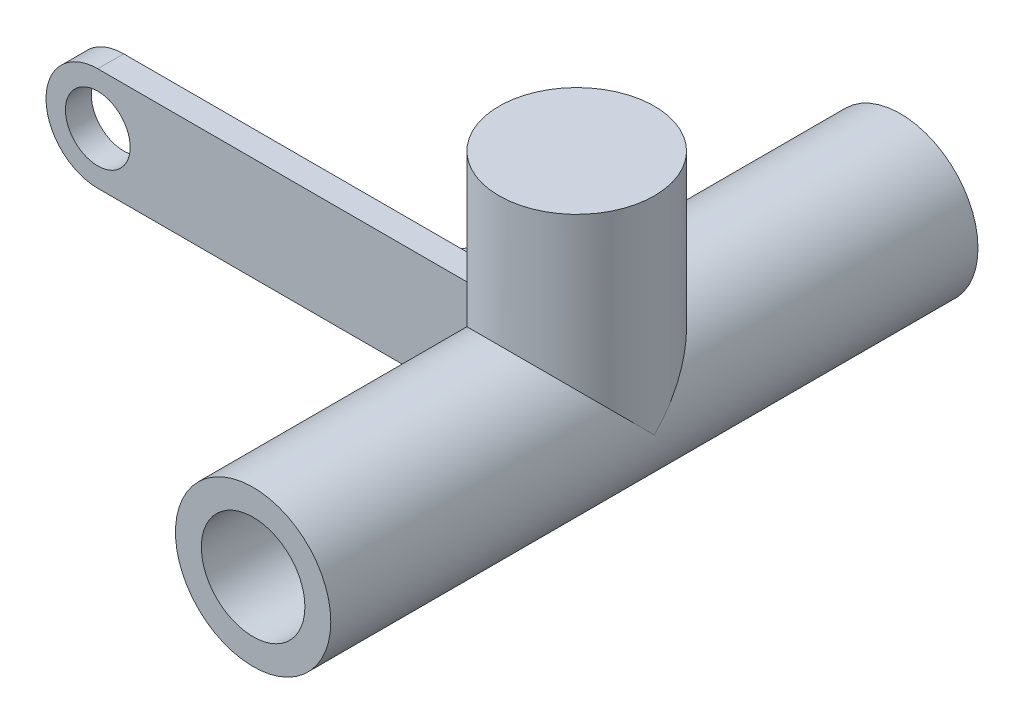
ISO-10303-21;
HEADER;
FILE_DESCRIPTION(('STEP AP214'),'2;1');
FILE_NAME('part.step','',(''),(''),'','','');
FILE_SCHEMA(('AUTOMOTIVE_DESIGN { 1 0 10303 214 1 1 1 1 }'));
ENDSEC;
DATA;
#1=APPLICATION_CONTEXT('core data for automotive mechanical design processes');
#2=APPLICATION_PROTOCOL_DEFINITION('international standard','automotive_design',2000,#1);
#3=PRODUCT_CONTEXT('',#1,'mechanical');
#4=PRODUCT('Part','Part','',(#3));
#5=PRODUCT_RELATED_PRODUCT_CATEGORY('part','',(#4));
#6=PRODUCT_DEFINITION_FORMATION('','',#4);
#7=PRODUCT_DEFINITION_CONTEXT('part definition',#1,'design');
#8=PRODUCT_DEFINITION('design','',#6,#7);
#9=PRODUCT_DEFINITION_SHAPE('','',#8);
#10=(LENGTH_UNIT() NAMED_UNIT(*) SI_UNIT(.MILLI.,.METRE.));
#11=(NAMED_UNIT(*) PLANE_ANGLE_UNIT() SI_UNIT($,.RADIAN.));
#12=(NAMED_UNIT(*) SI_UNIT($,.STERADIAN.) SOLID_ANGLE_UNIT());
#13=UNCERTAINTY_MEASURE_WITH_UNIT(LENGTH_MEASURE(1.E-05),#10,'distance_accuracy_value','');
#14=(GEOMETRIC_REPRESENTATION_CONTEXT(3) GLOBAL_UNCERTAINTY_ASSIGNED_CONTEXT((#13)) GLOBAL_UNIT_ASSIGNED_CONTEXT((#10,
#11,#12)) REPRESENTATION_CONTEXT('',''));
#15=CARTESIAN_POINT('',(0.,0.,0.));
#16=DIRECTION('',(0.,0.,1.));
#17=DIRECTION('',(1.,0.,0.));
#18=AXIS2_PLACEMENT_3D('',#15,#16,#17);
#19=CARTESIAN_POINT('',(0.,0.,125.));
#20=DIRECTION('',(0.,0.,-1.));
#21=DIRECTION('',(-1.,0.,0.));
#22=AXIS2_PLACEMENT_3D('',#19,#20,#21);
#23=CYLINDRICAL_SURFACE('',#22,15.);
#24=CARTESIAN_POINT('',(0.,0.,125.));
#25=DIRECTION('',(0.,0.,1.));
#26=DIRECTION('',(1.,0.,0.));
#27=AXIS2_PLACEMENT_3D('',#24,#25,#26);
#28=CIRCLE('',#27,15.);
#29=CARTESIAN_POINT('',(15.,0.,125.));
#30=VERTEX_POINT('',#29);
#31=EDGE_CURVE('E260',#30,#30,#28,.T.);
#32=ORIENTED_EDGE('',*,*,#31,.F.);
#33=EDGE_LOOP('',(#32));
#34=FACE_BOUND('',#33,.T.);
#35=CARTESIAN_POINT('',(0.,0.,0.));
#36=DIRECTION('',(0.,0.,1.));
#37=DIRECTION('',(1.,0.,0.));
#38=AXIS2_PLACEMENT_3D('',#35,#36,#37);
#39=CIRCLE('',#38,15.);
#40=CARTESIAN_POINT('',(15.,0.,0.));
#41=VERTEX_POINT('',#40);
#42=EDGE_CURVE('E256',#41,#41,#39,.T.);
#43=ORIENTED_EDGE('',*,*,#42,.T.);
#44=EDGE_LOOP('',(#43));
#45=FACE_BOUND('',#44,.T.);
#46=DIRECTION('',(0.,0.,-1.));
#47=VECTOR('',#46,1.);
#48=CARTESIAN_POINT('',(-14.9666295470958,-0.999999999999999,125.));
#49=LINE('',#48,#47);
#50=CARTESIAN_POINT('',(-14.9666295470958,-1.,30.));
#51=VERTEX_POINT('',#50);
#52=CARTESIAN_POINT('',(-14.9666295470958,-0.999999999999999,60.));
#53=VERTEX_POINT('',#52);
#54=EDGE_CURVE('E179',#51,#53,#49,.F.);
#55=ORIENTED_EDGE('',*,*,#54,.F.);
#56=CARTESIAN_POINT('',(0.,0.,30.));
#57=DIRECTION('',(0.,0.,-1.));
#58=DIRECTION('',(-1.,0.,0.));
#59=AXIS2_PLACEMENT_3D('',#56,#57,#58);
#60=CIRCLE('',#59,15.);
#61=CARTESIAN_POINT('',(-14.9666295470958,1.,30.));
#62=VERTEX_POINT('',#61);
#63=EDGE_CURVE('E11',#51,#62,#60,.T.);
#64=ORIENTED_EDGE('',*,*,#63,.T.);
#65=DIRECTION('',(0.,0.,-1.));
#66=VECTOR('',#65,1.);
#67=CARTESIAN_POINT('',(-14.9666295470958,1.,125.));
#68=LINE('',#67,#66);
#69=CARTESIAN_POINT('',(-14.9666295470958,1.,60.));
#70=VERTEX_POINT('',#69);
#71=EDGE_CURVE('E168',#70,#62,#68,.T.);
#72=ORIENTED_EDGE('',*,*,#71,.F.);
#73=CARTESIAN_POINT('',(0.,0.,60.));
#74=DIRECTION('',(0.,0.,-1.));
#75=DIRECTION('',(-1.,0.,0.));
#76=AXIS2_PLACEMENT_3D('',#73,#74,#75);
#77=CIRCLE('',#76,15.);
#78=CARTESIAN_POINT('',(-14.790199457749,2.5,60.));
#79=VERTEX_POINT('',#78);
#80=EDGE_CURVE('E175',#70,#79,#77,.T.);
#81=ORIENTED_EDGE('',*,*,#80,.T.);
#82=CARTESIAN_POINT('',(0.,0.,62.5));
#83=DIRECTION('',(0.,-0.707106781186547,-0.707106781186547));
#84=DIRECTION('',(0.,0.707106781186547,-0.707106781186547));
#85=AXIS2_PLACEMENT_3D('',#82,#83,#84);
#86=ELLIPSE('',#85,21.2132034355964,15.);
#87=CARTESIAN_POINT('',(15.,0.,62.5));
#88=VERTEX_POINT('',#87);
#89=EDGE_CURVE('E247',#88,#79,#86,.F.);
#90=ORIENTED_EDGE('',*,*,#89,.F.);
#91=CARTESIAN_POINT('',(0.,0.,62.5));
#92=DIRECTION('',(0.,0.707106781186547,-0.707106781186547));
#93=DIRECTION('',(0.,-0.707106781186547,-0.707106781186547));
#94=AXIS2_PLACEMENT_3D('',#91,#92,#93);
#95=ELLIPSE('',#94,21.2132034355964,15.);
#96=CARTESIAN_POINT('',(-14.790199457749,2.5,65.));
#97=VERTEX_POINT('',#96);
#98=EDGE_CURVE('E240',#97,#88,#95,.T.);
#99=ORIENTED_EDGE('',*,*,#98,.F.);
#100=CARTESIAN_POINT('',(0.,0.,65.));
#101=DIRECTION('',(0.,0.,1.));
#102=DIRECTION('',(1.,0.,0.));
#103=AXIS2_PLACEMENT_3D('',#100,#101,#102);
#104=CIRCLE('',#103,15.);
#105=CARTESIAN_POINT('',(-11.1803398874989,-10.,65.));
#106=VERTEX_POINT('',#105);
#107=EDGE_CURVE('E220',#97,#106,#104,.T.);
#108=ORIENTED_EDGE('',*,*,#107,.T.);
#109=DIRECTION('',(0.,0.,-1.));
#110=VECTOR('',#109,1.);
#111=CARTESIAN_POINT('',(-11.180339887499,-10.,125.));
#112=LINE('',#111,#110);
#113=CARTESIAN_POINT('',(-11.1803398874989,-10.,60.));
#114=VERTEX_POINT('',#113);
#115=EDGE_CURVE('E231',#106,#114,#112,.T.);
#116=ORIENTED_EDGE('',*,*,#115,.T.);
#117=EDGE_CURVE('E209',#114,#53,#77,.T.);
#118=ORIENTED_EDGE('',*,*,#117,.T.);
#119=EDGE_LOOP('',(#55,#64,#72,#81,#90,#99,#108,#116,#118));
#120=FACE_BOUND('',#119,.T.);
#121=ADVANCED_FACE('F43',(#34,#45,#120),#23,.T.);
#122=CARTESIAN_POINT('',(-100.,-10.,60.));
#123=DIRECTION('',(0.,0.,-1.));
#124=DIRECTION('',(-1.,0.,0.));
#125=AXIS2_PLACEMENT_3D('',#122,#123,#124);
#126=PLANE('',#125);
#127=CARTESIAN_POINT('',(-90.,0.,60.));
#128=DIRECTION('',(0.,0.,-1.));
#129=DIRECTION('',(-1.,0.,0.));
#130=AXIS2_PLACEMENT_3D('',#127,#128,#129);
#131=CIRCLE('',#130,6.25);
#132=CARTESIAN_POINT('',(-96.25,0.,60.));
#133=VERTEX_POINT('',#132);
#134=EDGE_CURVE('E438',#133,#133,#131,.T.);
#135=ORIENTED_EDGE('',*,*,#134,.F.);
#136=EDGE_LOOP('',(#135));
#137=FACE_BOUND('',#136,.T.);
#138=DIRECTION('',(1.,0.,0.));
#139=VECTOR('',#138,1.);
#140=CARTESIAN_POINT('',(-14.,1.,60.));
#141=LINE('',#140,#139);
#142=CARTESIAN_POINT('',(-42.03455484,1.,60.));
#143=VERTEX_POINT('',#142);
#144=EDGE_CURVE('E162',#143,#70,#141,.T.);
#145=ORIENTED_EDGE('',*,*,#144,.F.);
#146=DIRECTION('',(0.,1.,0.));
#147=VECTOR('',#146,1.);
#148=CARTESIAN_POINT('',(-42.03455484,1.,60.));
#149=LINE('',#148,#147);
#150=CARTESIAN_POINT('',(-42.03455484,-0.999999999999999,60.));
#151=VERTEX_POINT('',#150);
#152=EDGE_CURVE('E149',#151,#143,#149,.T.);
#153=ORIENTED_EDGE('',*,*,#152,.F.);
#154=DIRECTION('',(1.,0.,0.));
#155=VECTOR('',#154,1.);
#156=CARTESIAN_POINT('',(-100.,-0.999999999999999,60.));
#157=LINE('',#156,#155);
#158=EDGE_CURVE('E53',#151,#53,#157,.T.);
#159=ORIENTED_EDGE('',*,*,#158,.T.);
#160=ORIENTED_EDGE('',*,*,#117,.F.);
#161=DIRECTION('',(1.,0.,0.));
#162=VECTOR('',#161,1.);
#163=CARTESIAN_POINT('',(-100.,-10.,60.));
#164=LINE('',#163,#162);
#165=CARTESIAN_POINT('',(-90.,-10.,60.));
#166=VERTEX_POINT('',#165);
#167=EDGE_CURVE('E204',#166,#114,#164,.T.);
#168=ORIENTED_EDGE('',*,*,#167,.F.);
#169=CARTESIAN_POINT('',(-90.,0.,60.));
#170=DIRECTION('',(0.,0.,-1.));
#171=DIRECTION('',(-1.,0.,0.));
#172=AXIS2_PLACEMENT_3D('',#169,#170,#171);
#173=CIRCLE('',#172,10.);
#174=CARTESIAN_POINT('',(-100.,0.,60.));
#175=VERTEX_POINT('',#174);
#176=EDGE_CURVE('E376',#166,#175,#173,.T.);
#177=ORIENTED_EDGE('',*,*,#176,.T.);
#178=CARTESIAN_POINT('',(-90.,0.,60.));
#179=DIRECTION('',(0.,0.,-1.));
#180=DIRECTION('',(-1.,0.,0.));
#181=AXIS2_PLACEMENT_3D('',#178,#179,#180);
#182=CIRCLE('',#181,10.);
#183=CARTESIAN_POINT('',(-90.,10.,60.));
#184=VERTEX_POINT('',#183);
#185=EDGE_CURVE('E390',#175,#184,#182,.T.);
#186=ORIENTED_EDGE('',*,*,#185,.T.);
#187=DIRECTION('',(1.,0.,0.));
#188=VECTOR('',#187,1.);
#189=CARTESIAN_POINT('',(-100.,10.,60.));
#190=LINE('',#189,#188);
#191=CARTESIAN_POINT('',(-14.790199457749,10.,60.));
#192=VERTEX_POINT('',#191);
#193=EDGE_CURVE('E201',#184,#192,#190,.T.);
#194=ORIENTED_EDGE('',*,*,#193,.T.);
#195=DIRECTION('',(0.,-1.,0.));
#196=VECTOR('',#195,1.);
#197=CARTESIAN_POINT('',(-14.790199457749,40.,60.));
#198=LINE('',#197,#196);
#199=EDGE_CURVE('E409',#79,#192,#198,.F.);
#200=ORIENTED_EDGE('',*,*,#199,.F.);
#201=ORIENTED_EDGE('',*,*,#80,.F.);
#202=EDGE_LOOP('',(#145,#153,#159,#160,#168,#177,#186,#194,#200,#201));
#203=FACE_BOUND('',#202,.T.);
#204=ADVANCED_FACE('F173',(#137,#203),#126,.T.);
#205=CARTESIAN_POINT('',(0.,0.,125.));
#206=DIRECTION('',(0.,0.,-1.));
#207=DIRECTION('',(-1.,0.,0.));
#208=AXIS2_PLACEMENT_3D('',#205,#206,#207);
#209=CYLINDRICAL_SURFACE('',#208,10.);
#210=CARTESIAN_POINT('',(0.,0.,65.));
#211=DIRECTION('',(0.,0.,1.));
#212=DIRECTION('',(1.,0.,0.));
#213=AXIS2_PLACEMENT_3D('',#210,#211,#212);
#214=CIRCLE('',#213,10.);
#215=CARTESIAN_POINT('',(-10.,0.,65.));
#216=VERTEX_POINT('',#215);
#217=CARTESIAN_POINT('',(0.,-10.,65.));
#218=VERTEX_POINT('',#217);
#219=EDGE_CURVE('E228',#216,#218,#214,.T.);
#220=ORIENTED_EDGE('',*,*,#219,.F.);
#221=DIRECTION('',(0.,0.,-1.));
#222=VECTOR('',#221,1.);
#223=CARTESIAN_POINT('',(-10.,0.,125.));
#224=LINE('',#223,#222);
#225=CARTESIAN_POINT('',(-10.,0.,73.6803398874989));
#226=VERTEX_POINT('',#225);
#227=EDGE_CURVE('E264',#216,#226,#224,.F.);
#228=ORIENTED_EDGE('',*,*,#227,.T.);
#229=CARTESIAN_POINT('',(-10.,0.,73.6803398874989));
#230=CARTESIAN_POINT('',(-10.0000019662644,0.122908083291886,73.6803341285554));
#231=CARTESIAN_POINT('',(-9.99773339672962,0.245795438662537,73.682367652214));
#232=CARTESIAN_POINT('',(-9.98868075195431,0.491259157771999,73.6904562528802));
#233=CARTESIAN_POINT('',(-9.98189712810506,0.613835551369558,73.696510927874));
#234=CARTESIAN_POINT('',(-9.95484008556213,0.980341470499923,73.7205962021832));
#235=CARTESIAN_POINT('',(-9.92786031801124,1.22344075436707,73.7445484143372));
#236=CARTESIAN_POINT('',(-9.85692199140147,1.70271606910721,73.8067794801167));
#237=CARTESIAN_POINT('',(-9.81313360307206,1.93893674586964,73.8449146287484));
#238=CARTESIAN_POINT('',(-9.70933595979468,2.40539084014844,73.9338733583765));
#239=CARTESIAN_POINT('',(-9.64932198669643,2.63562249476913,73.9847006297178));
#240=CARTESIAN_POINT('',(-9.51430209888207,3.08762076307501,74.0967965567621));
#241=CARTESIAN_POINT('',(-9.43937638209315,3.30942540898784,74.1580091094161));
#242=CARTESIAN_POINT('',(-9.2752123820489,3.74494680876639,74.2890411827064));
#243=CARTESIAN_POINT('',(-9.18597482688439,3.95866397338595,74.3588602654582));
#244=CARTESIAN_POINT('',(-8.89735329466268,4.58807557587278,74.5787194524851));
#245=CARTESIAN_POINT('',(-8.67735629737759,4.9910554450501,74.7389043780611));
#246=CARTESIAN_POINT('',(-8.29129524792108,5.59675485228079,75.0013515100961));
#247=CARTESIAN_POINT('',(-8.14170204702141,5.81216410863114,75.0994998696131));
#248=CARTESIAN_POINT('',(-7.8264923183353,6.23012673255033,75.2976804602116));
#249=CARTESIAN_POINT('',(-7.66087472678607,6.43267924515728,75.3977128160049));
#250=CARTESIAN_POINT('',(-7.31418209262196,6.8243065835301,75.5974342938179));
#251=CARTESIAN_POINT('',(-7.13310489225783,7.01337952112642,75.6971233658976));
#252=CARTESIAN_POINT('',(-6.75590366095745,7.37743148512814,75.8941428962359));
#253=CARTESIAN_POINT('',(-6.55977230733853,7.55240356663882,75.9914721759597));
#254=CARTESIAN_POINT('',(-6.1235004030377,7.91162090637637,76.1955771283599));
#255=CARTESIAN_POINT('',(-5.88110397785952,8.09352620425258,76.3016735607452));
#256=CARTESIAN_POINT('',(-5.37841190890662,8.43594148342965,76.5052195059547));
#257=CARTESIAN_POINT('',(-5.11812584836926,8.59646278650464,76.6026735852692));
#258=CARTESIAN_POINT('',(-4.58092530474232,8.89434642230069,76.7862046380633));
#259=CARTESIAN_POINT('',(-4.30401783641956,9.03171843285677,76.8722863626223));
#260=CARTESIAN_POINT('',(-3.73529722016773,9.28137561061249,77.0304715239106));
#261=CARTESIAN_POINT('',(-3.44348728334321,9.39366615444473,77.1025779560387));
#262=CARTESIAN_POINT('',(-2.88082821284893,9.58011233592226,77.223250182534));
#263=CARTESIAN_POINT('',(-2.61129919972899,9.65713262962674,77.2735492311711));
#264=CARTESIAN_POINT('',(-2.0645294229625,9.78860280762324,77.3598209230397));
#265=CARTESIAN_POINT('',(-1.78728918107016,9.84305421501748,77.3957945330429));
#266=CARTESIAN_POINT('',(-1.22793917300902,9.92834932789231,77.4522941504247));
#267=CARTESIAN_POINT('',(-0.945834860668396,9.95921791293619,77.4728364372598));
#268=CARTESIAN_POINT('',(-0.379327505846203,9.99683241551685,77.4978816841611));
#269=CARTESIAN_POINT('',(-0.094924793379789,10.0035817366327,77.50238690729));
#270=CARTESIAN_POINT('',(0.42989033312902,9.99365946293529,77.4957738621773));
#271=CARTESIAN_POINT('',(0.670405430373816,9.98039843933322,77.4869306305415));
#272=CARTESIAN_POINT('',(1.14916934748079,9.93665826160711,77.4578376542313));
#273=CARTESIAN_POINT('',(1.38741821686984,9.90617948464865,77.4375881594182));
#274=CARTESIAN_POINT('',(1.8599416134959,9.82842601275427,77.3861382030705));
#275=CARTESIAN_POINT('',(2.09421618238098,9.78115149394085,77.3549378563681));
#276=CARTESIAN_POINT('',(2.55727839003123,9.67041909157562,77.2822617118014));
#277=CARTESIAN_POINT('',(2.78606579121633,9.60696050867491,77.2407854698954));
#278=CARTESIAN_POINT('',(3.23586004110859,9.46491433929526,77.1486073470994));
#279=CARTESIAN_POINT('',(3.45689579211392,9.38639210985778,77.0979453708846));
#280=CARTESIAN_POINT('',(3.89118343175868,9.21483719709088,76.9882323039131));
#281=CARTESIAN_POINT('',(4.1044327303078,9.1217997387039,76.9291784530634));
#282=CARTESIAN_POINT('',(4.52213359273533,8.9221009894455,76.8037704642793));
#283=CARTESIAN_POINT('',(4.72658750024244,8.81544335825792,76.7374182880364));
#284=CARTESIAN_POINT('',(5.12613026843351,8.58926728521921,76.5984944832681));
#285=CARTESIAN_POINT('',(5.32121574797326,8.46974424983818,76.5259206352203));
#286=CARTESIAN_POINT('',(5.72633078565189,8.20216646387367,76.3658779971488));
#287=CARTESIAN_POINT('',(5.93496872233939,8.05242530391318,76.2777035729189));
#288=CARTESIAN_POINT('',(6.33894603460613,7.73842700250566,76.0965729756602));
#289=CARTESIAN_POINT('',(6.53427941602822,7.57416339378907,76.0036146800134));
#290=CARTESIAN_POINT('',(6.91132960510199,7.23176778878176,75.8145806026908));
#291=CARTESIAN_POINT('',(7.09302687376191,7.05361661073946,75.7185006199906));
#292=CARTESIAN_POINT('',(7.44198959608793,6.68440712720149,75.5252280827419));
#293=CARTESIAN_POINT('',(7.60925973806327,6.49335305095354,75.4280359013365));
#294=CARTESIAN_POINT('',(7.95384735185595,6.06814596506086,75.2193915728319));
#295=CARTESIAN_POINT('',(8.12868447910812,5.83191005670115,75.1080713984021));
#296=CARTESIAN_POINT('',(8.45775206098623,5.34351489749032,74.8897309634299));
#297=CARTESIAN_POINT('',(8.61197769657104,5.09135194306177,74.7827117125346));
#298=CARTESIAN_POINT('',(8.89853128768456,4.57208818968848,74.5767233207897));
#299=CARTESIAN_POINT('',(9.03088152717082,4.30500296758524,74.4777460406991));
#300=CARTESIAN_POINT('',(9.27240645990512,3.75661281001168,74.2917648681875));
#301=CARTESIAN_POINT('',(9.38159284001154,3.47531513427529,74.2047549457079));
#302=CARTESIAN_POINT('',(9.54801158638536,2.9804793272992,74.0690778214802));
#303=CARTESIAN_POINT('',(9.61123177037526,2.770013403874,74.0164952118853));
#304=CARTESIAN_POINT('',(9.72408164930214,2.34326880833405,73.9213698799915));
#305=CARTESIAN_POINT('',(9.77371524585155,2.12699182459367,73.878824275887));
#306=CARTESIAN_POINT('',(9.85861049231009,1.69030911284007,73.8053505181962));
#307=CARTESIAN_POINT('',(9.89391085780338,1.46991621176618,73.7743910871009));
#308=CARTESIAN_POINT('',(9.94974461286417,1.02594789295992,73.7251497436318));
#309=CARTESIAN_POINT('',(9.97028723032151,0.802374553285027,73.7068599093269));
#310=CARTESIAN_POINT('',(9.98884716882532,0.481904573199954,73.6903071254827));
#311=CARTESIAN_POINT('',(9.99302852832223,0.385592968518363,73.6865722173172));
#312=CARTESIAN_POINT('',(9.99860456831422,0.192858527287807,73.6815883268953));
#313=CARTESIAN_POINT('',(10.0000002177439,0.0964357410905485,73.6803384802773));
#314=CARTESIAN_POINT('',(10.,0.,73.680339887499));
#315=B_SPLINE_CURVE_WITH_KNOTS('',3,(#229,#230,#231,#232,#233,#234,#235,#236,#237,#238,#239,
#240,#241,#242,#243,#244,#245,#246,#247,#248,#249,#250,#251,#252,#253,#254,#255,#256,#257,#258,
#259,#260,#261,#262,#263,#264,#265,#266,#267,#268,#269,#270,#271,#272,#273,#274,#275,#276,#277,
#278,#279,#280,#281,#282,#283,#284,#285,#286,#287,#288,#289,#290,#291,#292,#293,#294,#295,#296,
#297,#298,#299,#300,#301,#302,#303,#304,#305,#306,#307,#308,#309,#310,#311,#312,#313,#314),
.UNSPECIFIED.,.F.,.F.,(4,2,2,2,2,2,2,2,2,2,2,2,2,2,2,2,2,2,2,2,2,2,2,2,2,2,2,2,2,2,2,2,2,2,2,2,
2,2,2,2,2,2,4),(0.,0.368646050186405,0.737255250621695,1.47329974643748,2.20208108990007,
2.93107458010894,3.65624850314493,4.38138554586728,5.83478174144706,6.67426475194119,
7.513803528942,8.35345967533994,9.19352686995974,10.1555208892916,11.1170035384646,
12.078083225863,13.0389566915795,13.8920552544147,14.745096234968,15.5972360211362,
16.4492555532334,17.1715077978443,17.8937442216846,18.6159730722762,19.3382331372499,
20.0574276279281,20.7768592119827,21.4960978929086,22.2155942317108,23.0293731080495,
23.8435162270739,24.658804488051,25.4738268028542,26.4155476148543,27.3574882208219,
28.2984632997486,29.2389624936457,29.9162147428955,30.5932723034906,31.2684886948951,
31.9432825110777,32.2326465857274,32.5219099952884),.UNSPECIFIED.);
#316=CARTESIAN_POINT('',(10.,0.,73.6803398874989));
#317=VERTEX_POINT('',#316);
#318=EDGE_CURVE('E272',#226,#317,#315,.T.);
#319=ORIENTED_EDGE('',*,*,#318,.T.);
#320=DIRECTION('',(0.,0.,-1.));
#321=VECTOR('',#320,1.);
#322=CARTESIAN_POINT('',(10.,0.,125.));
#323=LINE('',#322,#321);
#324=CARTESIAN_POINT('',(10.,0.,51.319660112501));
#325=VERTEX_POINT('',#324);
#326=EDGE_CURVE('E412',#317,#325,#323,.T.);
#327=ORIENTED_EDGE('',*,*,#326,.T.);
#328=CARTESIAN_POINT('',(10.,0.,51.319660112501));
#329=CARTESIAN_POINT('',(10.0000019662644,0.122908083291886,51.3196658714446));
#330=CARTESIAN_POINT('',(9.99773339672962,0.245795438662537,51.317632347786));
#331=CARTESIAN_POINT('',(9.98868075195431,0.491259157771998,51.3095437471198));
#332=CARTESIAN_POINT('',(9.98189712810506,0.613835551369558,51.303489072126));
#333=CARTESIAN_POINT('',(9.95484008556213,0.980341470499924,51.2794037978168));
#334=CARTESIAN_POINT('',(9.92786031801123,1.22344075436707,51.2554515856628));
#335=CARTESIAN_POINT('',(9.85692199140147,1.70271606910721,51.1932205198833));
#336=CARTESIAN_POINT('',(9.81313360307206,1.93893674586964,51.1550853712516));
#337=CARTESIAN_POINT('',(9.70933595979468,2.40539084014844,51.0661266416235));
#338=CARTESIAN_POINT('',(9.64932198669643,2.63562249476913,51.0152993702821));
#339=CARTESIAN_POINT('',(9.51430209888207,3.08762076307501,50.9032034432378));
#340=CARTESIAN_POINT('',(9.43937638209315,3.30942540898784,50.8419908905839));
#341=CARTESIAN_POINT('',(9.2752123820489,3.7449468087664,50.7109588172936));
#342=CARTESIAN_POINT('',(9.18597482688439,3.95866397338596,50.6411397345418));
#343=CARTESIAN_POINT('',(8.89735329466268,4.58807557587278,50.4212805475149));
#344=CARTESIAN_POINT('',(8.67735629737758,4.9910554450501,50.2610956219389));
#345=CARTESIAN_POINT('',(8.29129524792107,5.5967548522808,49.9986484899039));
#346=CARTESIAN_POINT('',(8.1417020470214,5.81216410863114,49.9005001303869));
#347=CARTESIAN_POINT('',(7.82649231833529,6.23012673255034,49.7023195397884));
#348=CARTESIAN_POINT('',(7.66087472678606,6.43267924515728,49.6022871839951));
#349=CARTESIAN_POINT('',(7.31418209262196,6.82430658353011,49.4025657061821));
#350=CARTESIAN_POINT('',(7.13310489225783,7.01337952112643,49.3028766341024));
#351=CARTESIAN_POINT('',(6.75590366095745,7.37743148512814,49.1058571037641));
#352=CARTESIAN_POINT('',(6.55977230733853,7.55240356663883,49.0085278240403));
#353=CARTESIAN_POINT('',(6.12350040303769,7.91162090637637,48.8044228716401));
#354=CARTESIAN_POINT('',(5.88110397785951,8.09352620425258,48.6983264392548));
#355=CARTESIAN_POINT('',(5.37841190890662,8.43594148342965,48.4947804940453));
#356=CARTESIAN_POINT('',(5.11812584836926,8.59646278650464,48.3973264147308));
#357=CARTESIAN_POINT('',(4.58092530474232,8.89434642230069,48.2137953619367));
#358=CARTESIAN_POINT('',(4.30401783641956,9.03171843285677,48.1277136373777));
#359=CARTESIAN_POINT('',(3.73529722016773,9.28137561061249,47.9695284760894));
#360=CARTESIAN_POINT('',(3.44348728334321,9.39366615444473,47.8974220439613));
#361=CARTESIAN_POINT('',(2.88082821284893,9.58011233592226,47.776749817466));
#362=CARTESIAN_POINT('',(2.61129919972898,9.65713262962674,47.7264507688289));
#363=CARTESIAN_POINT('',(2.0645294229625,9.78860280762324,47.6401790769603));
#364=CARTESIAN_POINT('',(1.78728918107017,9.84305421501748,47.6042054669571));
#365=CARTESIAN_POINT('',(1.22793917300902,9.92834932789231,47.5477058495753));
#366=CARTESIAN_POINT('',(0.945834860668397,9.95921791293619,47.5271635627402));
#367=CARTESIAN_POINT('',(0.379327505846205,9.99683241551685,47.5021183158389));
#368=CARTESIAN_POINT('',(0.0949247933797915,10.0035817366327,47.49761309271));
#369=CARTESIAN_POINT('',(-0.429890333129018,9.99365946293529,47.5042261378227));
#370=CARTESIAN_POINT('',(-0.670405430373816,9.98039843933322,47.5130693694585));
#371=CARTESIAN_POINT('',(-1.14916934748079,9.93665826160711,47.5421623457687));
#372=CARTESIAN_POINT('',(-1.38741821686984,9.90617948464865,47.5624118405818));
#373=CARTESIAN_POINT('',(-1.8599416134959,9.82842601275427,47.6138617969295));
#374=CARTESIAN_POINT('',(-2.09421618238097,9.78115149394085,47.6450621436319));
#375=CARTESIAN_POINT('',(-2.55727839003123,9.67041909157562,47.7177382881986));
#376=CARTESIAN_POINT('',(-2.78606579121632,9.60696050867492,47.7592145301046));
#377=CARTESIAN_POINT('',(-3.23586004110859,9.46491433929526,47.8513926529006));
#378=CARTESIAN_POINT('',(-3.45689579211392,9.38639210985778,47.9020546291154));
#379=CARTESIAN_POINT('',(-3.89118343175868,9.21483719709088,48.0117676960869));
#380=CARTESIAN_POINT('',(-4.10443273030779,9.1217997387039,48.0708215469366));
#381=CARTESIAN_POINT('',(-4.52213359273533,8.9221009894455,48.1962295357207));
#382=CARTESIAN_POINT('',(-4.72658750024245,8.81544335825792,48.2625817119636));
#383=CARTESIAN_POINT('',(-5.12613026843352,8.58926728521921,48.401505516732));
#384=CARTESIAN_POINT('',(-5.32121574797326,8.46974424983818,48.4740793647797));
#385=CARTESIAN_POINT('',(-5.72633078565189,8.20216646387367,48.6341220028512));
#386=CARTESIAN_POINT('',(-5.93496872233939,8.05242530391318,48.7222964270811));
#387=CARTESIAN_POINT('',(-6.33894603460613,7.73842700250566,48.9034270243398));
#388=CARTESIAN_POINT('',(-6.53427941602822,7.57416339378907,48.9963853199866));
#389=CARTESIAN_POINT('',(-6.91132960510199,7.23176778878176,49.1854193973092));
#390=CARTESIAN_POINT('',(-7.09302687376191,7.05361661073946,49.2814993800094));
#391=CARTESIAN_POINT('',(-7.44198959608793,6.68440712720149,49.4747719172581));
#392=CARTESIAN_POINT('',(-7.60925973806327,6.49335305095354,49.5719640986635));
#393=CARTESIAN_POINT('',(-7.95384735185595,6.06814596506086,49.7806084271681));
#394=CARTESIAN_POINT('',(-8.12868447910812,5.83191005670115,49.8919286015979));
#395=CARTESIAN_POINT('',(-8.45775206098623,5.34351489749032,50.1102690365701));
#396=CARTESIAN_POINT('',(-8.61197769657104,5.09135194306177,50.2172882874654));
#397=CARTESIAN_POINT('',(-8.89853128768456,4.57208818968848,50.4232766792104));
#398=CARTESIAN_POINT('',(-9.03088152717082,4.30500296758524,50.5222539593009));
#399=CARTESIAN_POINT('',(-9.27240645990512,3.75661281001168,50.7082351318125));
#400=CARTESIAN_POINT('',(-9.38159284001154,3.47531513427529,50.7952450542921));
#401=CARTESIAN_POINT('',(-9.54801158638536,2.9804793272992,50.9309221785198));
#402=CARTESIAN_POINT('',(-9.61123177037526,2.770013403874,50.9835047881147));
#403=CARTESIAN_POINT('',(-9.72408164930214,2.34326880833405,51.0786301200086));
#404=CARTESIAN_POINT('',(-9.77371524585155,2.12699182459367,51.121175724113));
#405=CARTESIAN_POINT('',(-9.85861049231009,1.69030911284007,51.1946494818038));
#406=CARTESIAN_POINT('',(-9.89391085780338,1.46991621176618,51.2256089128991));
#407=CARTESIAN_POINT('',(-9.94974461286417,1.02594789295992,51.2748502563682));
#408=CARTESIAN_POINT('',(-9.97028723032151,0.802374553285026,51.2931400906731));
#409=CARTESIAN_POINT('',(-9.98884716882532,0.481904573199953,51.3096928745173));
#410=CARTESIAN_POINT('',(-9.99302852832223,0.385592968518362,51.3134277826828));
#411=CARTESIAN_POINT('',(-9.99860456831422,0.192858527287807,51.3184116731047));
#412=CARTESIAN_POINT('',(-10.0000002177439,0.0964357410905482,51.3196615197227));
#413=CARTESIAN_POINT('',(-10.,0.,51.3196601125011));
#414=B_SPLINE_CURVE_WITH_KNOTS('',3,(#328,#329,#330,#331,#332,#333,#334,#335,#336,#337,#338,
#339,#340,#341,#342,#343,#344,#345,#346,#347,#348,#349,#350,#351,#352,#353,#354,#355,#356,#357,
#358,#359,#360,#361,#362,#363,#364,#365,#366,#367,#368,#369,#370,#371,#372,#373,#374,#375,#376,
#377,#378,#379,#380,#381,#382,#383,#384,#385,#386,#387,#388,#389,#390,#391,#392,#393,#394,#395,
#396,#397,#398,#399,#400,#401,#402,#403,#404,#405,#406,#407,#408,#409,#410,#411,#412,#413),
.UNSPECIFIED.,.F.,.F.,(4,2,2,2,2,2,2,2,2,2,2,2,2,2,2,2,2,2,2,2,2,2,2,2,2,2,2,2,2,2,2,2,2,2,2,2,
2,2,2,2,2,2,4),(0.,0.368646050186405,0.737255250621695,1.47329974643748,2.20208108990007,
2.93107458010894,3.65624850314493,4.38138554586729,5.83478174144707,6.6742647519412,
7.51380352894201,8.35345967533995,9.19352686995974,10.1555208892916,11.1170035384646,
12.078083225863,13.0389566915795,13.8920552544147,14.745096234968,15.5972360211362,
16.4492555532334,17.1715077978443,17.8937442216846,18.6159730722762,19.3382331372499,
20.0574276279281,20.7768592119827,21.4960978929086,22.2155942317108,23.0293731080495,
23.8435162270739,24.658804488051,25.4738268028542,26.4155476148543,27.3574882208219,
28.2984632997486,29.2389624936457,29.9162147428955,30.5932723034906,31.2684886948951,
31.9432825110777,32.2326465857274,32.5219099952884),.UNSPECIFIED.);
#415=CARTESIAN_POINT('',(-10.,0.,51.3196601125011));
#416=VERTEX_POINT('',#415);
#417=EDGE_CURVE('E282',#325,#416,#414,.T.);
#418=ORIENTED_EDGE('',*,*,#417,.T.);
#419=CARTESIAN_POINT('',(-10.,0.,60.));
#420=VERTEX_POINT('',#419);
#421=EDGE_CURVE('E268',#416,#420,#224,.F.);
#422=ORIENTED_EDGE('',*,*,#421,.T.);
#423=CARTESIAN_POINT('',(0.,0.,60.));
#424=DIRECTION('',(0.,0.,-1.));
#425=DIRECTION('',(-1.,0.,0.));
#426=AXIS2_PLACEMENT_3D('',#423,#424,#425);
#427=CIRCLE('',#426,10.);
#428=CARTESIAN_POINT('',(0.,-10.,60.));
#429=VERTEX_POINT('',#428);
#430=EDGE_CURVE('E217',#429,#420,#427,.T.);
#431=ORIENTED_EDGE('',*,*,#430,.F.);
#432=DIRECTION('',(0.,0.,-1.));
#433=VECTOR('',#432,1.);
#434=CARTESIAN_POINT('',(0.,-10.,65.));
#435=LINE('',#434,#433);
#436=EDGE_CURVE('E190',#218,#429,#435,.T.);
#437=ORIENTED_EDGE('',*,*,#436,.F.);
#438=EDGE_LOOP('',(#220,#228,#319,#327,#418,#422,#431,#437));
#439=FACE_BOUND('',#438,.T.);
#440=CARTESIAN_POINT('',(0.,0.,125.));
#441=DIRECTION('',(0.,0.,1.));
#442=DIRECTION('',(1.,0.,0.));
#443=AXIS2_PLACEMENT_3D('',#440,#441,#442);
#444=CIRCLE('',#443,10.);
#445=CARTESIAN_POINT('',(10.,0.,125.));
#446=VERTEX_POINT('',#445);
#447=EDGE_CURVE('E252',#446,#446,#444,.T.);
#448=ORIENTED_EDGE('',*,*,#447,.T.);
#449=EDGE_LOOP('',(#448));
#450=FACE_BOUND('',#449,.T.);
#451=CARTESIAN_POINT('',(0.,0.,0.));
#452=DIRECTION('',(0.,0.,1.));
#453=DIRECTION('',(1.,0.,0.));
#454=AXIS2_PLACEMENT_3D('',#451,#452,#453);
#455=CIRCLE('',#454,10.);
#456=CARTESIAN_POINT('',(10.,0.,0.));
#457=VERTEX_POINT('',#456);
#458=EDGE_CURVE('E251',#457,#457,#455,.T.);
#459=ORIENTED_EDGE('',*,*,#458,.F.);
#460=EDGE_LOOP('',(#459));
#461=FACE_BOUND('',#460,.T.);
#462=ADVANCED_FACE('F288',(#439,#450,#461),#209,.F.);
#463=CARTESIAN_POINT('',(0.,0.,125.));
#464=DIRECTION('',(0.,0.,1.));
#465=DIRECTION('',(1.,0.,0.));
#466=AXIS2_PLACEMENT_3D('',#463,#464,#465);
#467=PLANE('',#466);
#468=ORIENTED_EDGE('',*,*,#31,.T.);
#469=EDGE_LOOP('',(#468));
#470=FACE_BOUND('',#469,.T.);
#471=ORIENTED_EDGE('',*,*,#447,.F.);
#472=EDGE_LOOP('',(#471));
#473=FACE_BOUND('',#472,.T.);
#474=ADVANCED_FACE('F529',(#470,#473),#467,.T.);
#475=CARTESIAN_POINT('',(0.,0.,0.));
#476=DIRECTION('',(0.,0.,1.));
#477=DIRECTION('',(1.,0.,0.));
#478=AXIS2_PLACEMENT_3D('',#475,#476,#477);
#479=PLANE('',#478);
#480=ORIENTED_EDGE('',*,*,#42,.F.);
#481=EDGE_LOOP('',(#480));
#482=FACE_BOUND('',#481,.T.);
#483=ORIENTED_EDGE('',*,*,#458,.T.);
#484=EDGE_LOOP('',(#483));
#485=FACE_BOUND('',#484,.T.);
#486=ADVANCED_FACE('F302',(#482,#485),#479,.F.);
#487=CARTESIAN_POINT('',(0.,0.,62.5));
#488=DIRECTION('',(0.,1.,0.));
#489=DIRECTION('',(0.,0.,1.));
#490=AXIS2_PLACEMENT_3D('',#487,#488,#489);
#491=PLANE('',#490);
#492=ORIENTED_EDGE('',*,*,#227,.F.);
#493=DIRECTION('',(1.,0.,0.));
#494=VECTOR('',#493,1.);
#495=CARTESIAN_POINT('',(0.,0.,65.));
#496=LINE('',#495,#494);
#497=CARTESIAN_POINT('',(0.,0.,65.));
#498=VERTEX_POINT('',#497);
#499=EDGE_CURVE('E224',#216,#498,#496,.T.);
#500=ORIENTED_EDGE('',*,*,#499,.T.);
#501=DIRECTION('',(0.,0.,-1.));
#502=VECTOR('',#501,1.);
#503=CARTESIAN_POINT('',(0.,0.,62.5));
#504=LINE('',#503,#502);
#505=CARTESIAN_POINT('',(0.,0.,60.));
#506=VERTEX_POINT('',#505);
#507=EDGE_CURVE('E395',#498,#506,#504,.T.);
#508=ORIENTED_EDGE('',*,*,#507,.T.);
#509=DIRECTION('',(-1.,0.,0.));
#510=VECTOR('',#509,1.);
#511=CARTESIAN_POINT('',(0.,0.,60.));
#512=LINE('',#511,#510);
#513=EDGE_CURVE('E213',#506,#420,#512,.T.);
#514=ORIENTED_EDGE('',*,*,#513,.T.);
#515=ORIENTED_EDGE('',*,*,#421,.F.);
#516=CARTESIAN_POINT('',(0.,0.,62.5));
#517=DIRECTION('',(0.,1.,0.));
#518=DIRECTION('',(0.,0.,1.));
#519=AXIS2_PLACEMENT_3D('',#516,#517,#518);
#520=CIRCLE('',#519,15.);
#521=EDGE_CURVE('E241',#325,#416,#520,.T.);
#522=ORIENTED_EDGE('',*,*,#521,.F.);
#523=ORIENTED_EDGE('',*,*,#326,.F.);
#524=EDGE_CURVE('E235',#226,#317,#520,.T.);
#525=ORIENTED_EDGE('',*,*,#524,.F.);
#526=EDGE_LOOP('',(#492,#500,#508,#514,#515,#522,#523,#525));
#527=FACE_BOUND('',#526,.T.);
#528=ADVANCED_FACE('F296',(#527),#491,.F.);
#529=CARTESIAN_POINT('',(0.,40.,62.5));
#530=DIRECTION('',(0.,-1.,0.));
#531=DIRECTION('',(0.,0.,-1.));
#532=AXIS2_PLACEMENT_3D('',#529,#530,#531);
#533=CYLINDRICAL_SURFACE('',#532,15.);
#534=ORIENTED_EDGE('',*,*,#318,.F.);
#535=ORIENTED_EDGE('',*,*,#524,.T.);
#536=EDGE_LOOP('',(#534,#535));
#537=FACE_BOUND('',#536,.T.);
#538=ADVANCED_FACE('F291',(#537),#533,.T.);
#539=ORIENTED_EDGE('',*,*,#417,.F.);
#540=ORIENTED_EDGE('',*,*,#521,.T.);
#541=EDGE_LOOP('',(#539,#540));
#542=FACE_BOUND('',#541,.T.);
#543=ADVANCED_FACE('F295',(#542),#533,.T.);
#544=CARTESIAN_POINT('',(0.,40.,62.5));
#545=DIRECTION('',(0.,1.,0.));
#546=DIRECTION('',(0.,0.,1.));
#547=AXIS2_PLACEMENT_3D('',#544,#545,#546);
#548=CIRCLE('',#547,15.);
#549=CARTESIAN_POINT('',(0.,40.,77.5));
#550=VERTEX_POINT('',#549);
#551=EDGE_CURVE('E236',#550,#550,#548,.T.);
#552=ORIENTED_EDGE('',*,*,#551,.F.);
#553=EDGE_LOOP('',(#552));
#554=FACE_BOUND('',#553,.T.);
#555=CARTESIAN_POINT('',(0.,10.,62.5));
#556=DIRECTION('',(0.,1.,0.));
#557=DIRECTION('',(0.,0.,1.));
#558=AXIS2_PLACEMENT_3D('',#555,#556,#557);
#559=CIRCLE('',#558,15.);
#560=CARTESIAN_POINT('',(-14.790199457749,10.,65.));
#561=VERTEX_POINT('',#560);
#562=EDGE_CURVE('E405',#192,#561,#559,.T.);
#563=ORIENTED_EDGE('',*,*,#562,.T.);
#564=DIRECTION('',(0.,-1.,0.));
#565=VECTOR('',#564,1.);
#566=CARTESIAN_POINT('',(-14.790199457749,40.,65.));
#567=LINE('',#566,#565);
#568=EDGE_CURVE('E401',#561,#97,#567,.T.);
#569=ORIENTED_EDGE('',*,*,#568,.T.);
#570=ORIENTED_EDGE('',*,*,#98,.T.);
#571=ORIENTED_EDGE('',*,*,#89,.T.);
#572=ORIENTED_EDGE('',*,*,#199,.T.);
#573=EDGE_LOOP('',(#563,#569,#570,#571,#572));
#574=FACE_BOUND('',#573,.T.);
#575=ADVANCED_FACE('F298',(#554,#574),#533,.T.);
#576=CARTESIAN_POINT('',(0.,40.,62.5));
#577=DIRECTION('',(0.,1.,0.));
#578=DIRECTION('',(0.,0.,1.));
#579=AXIS2_PLACEMENT_3D('',#576,#577,#578);
#580=PLANE('',#579);
#581=ORIENTED_EDGE('',*,*,#551,.T.);
#582=EDGE_LOOP('',(#581));
#583=FACE_BOUND('',#582,.T.);
#584=ADVANCED_FACE('F304',(#583),#580,.T.);
#585=CARTESIAN_POINT('',(-100.,10.,65.));
#586=DIRECTION('',(0.,1.,0.));
#587=DIRECTION('',(0.,0.,1.));
#588=AXIS2_PLACEMENT_3D('',#585,#586,#587);
#589=PLANE('',#588);
#590=ORIENTED_EDGE('',*,*,#193,.F.);
#591=DIRECTION('',(0.,0.,1.));
#592=VECTOR('',#591,1.);
#593=CARTESIAN_POINT('',(-90.,10.,65.));
#594=LINE('',#593,#592);
#595=CARTESIAN_POINT('',(-90.,10.,65.));
#596=VERTEX_POINT('',#595);
#597=EDGE_CURVE('E68',#184,#596,#594,.T.);
#598=ORIENTED_EDGE('',*,*,#597,.T.);
#599=DIRECTION('',(1.,0.,0.));
#600=VECTOR('',#599,1.);
#601=CARTESIAN_POINT('',(-100.,10.,65.));
#602=LINE('',#601,#600);
#603=EDGE_CURVE('E198',#596,#561,#602,.T.);
#604=ORIENTED_EDGE('',*,*,#603,.T.);
#605=ORIENTED_EDGE('',*,*,#562,.F.);
#606=EDGE_LOOP('',(#590,#598,#604,#605));
#607=FACE_BOUND('',#606,.T.);
#608=ADVANCED_FACE('F307',(#607),#589,.T.);
#609=CARTESIAN_POINT('',(-100.,10.,65.));
#610=DIRECTION('',(0.,0.,1.));
#611=DIRECTION('',(1.,0.,0.));
#612=AXIS2_PLACEMENT_3D('',#609,#610,#611);
#613=PLANE('',#612);
#614=CARTESIAN_POINT('',(-90.,0.,65.));
#615=DIRECTION('',(0.,0.,1.));
#616=DIRECTION('',(1.,0.,0.));
#617=AXIS2_PLACEMENT_3D('',#614,#615,#616);
#618=CIRCLE('',#617,6.25);
#619=CARTESIAN_POINT('',(-83.75,0.,65.));
#620=VERTEX_POINT('',#619);
#621=EDGE_CURVE('E47',#620,#620,#618,.T.);
#622=ORIENTED_EDGE('',*,*,#621,.F.);
#623=EDGE_LOOP('',(#622));
#624=FACE_BOUND('',#623,.T.);
#625=CARTESIAN_POINT('',(-90.,0.,65.));
#626=DIRECTION('',(0.,0.,1.));
#627=DIRECTION('',(1.,0.,0.));
#628=AXIS2_PLACEMENT_3D('',#625,#626,#627);
#629=CIRCLE('',#628,10.);
#630=CARTESIAN_POINT('',(-100.,0.,65.));
#631=VERTEX_POINT('',#630);
#632=EDGE_CURVE('E60',#596,#631,#629,.T.);
#633=ORIENTED_EDGE('',*,*,#632,.T.);
#634=CARTESIAN_POINT('',(-90.,0.,65.));
#635=DIRECTION('',(0.,0.,1.));
#636=DIRECTION('',(1.,0.,0.));
#637=AXIS2_PLACEMENT_3D('',#634,#635,#636);
#638=CIRCLE('',#637,10.);
#639=CARTESIAN_POINT('',(-90.,-10.,65.));
#640=VERTEX_POINT('',#639);
#641=EDGE_CURVE('E367',#631,#640,#638,.T.);
#642=ORIENTED_EDGE('',*,*,#641,.T.);
#643=DIRECTION('',(1.,0.,0.));
#644=VECTOR('',#643,1.);
#645=CARTESIAN_POINT('',(-100.,-10.,65.));
#646=LINE('',#645,#644);
#647=EDGE_CURVE('E197',#640,#106,#646,.T.);
#648=ORIENTED_EDGE('',*,*,#647,.T.);
#649=ORIENTED_EDGE('',*,*,#107,.F.);
#650=ORIENTED_EDGE('',*,*,#568,.F.);
#651=ORIENTED_EDGE('',*,*,#603,.F.);
#652=EDGE_LOOP('',(#633,#642,#648,#649,#650,#651));
#653=FACE_BOUND('',#652,.T.);
#654=ADVANCED_FACE('F315',(#624,#653),#613,.T.);
#655=CARTESIAN_POINT('',(-100.,-10.,65.));
#656=DIRECTION('',(0.,-1.,0.));
#657=DIRECTION('',(0.,0.,-1.));
#658=AXIS2_PLACEMENT_3D('',#655,#656,#657);
#659=PLANE('',#658);
#660=ORIENTED_EDGE('',*,*,#647,.F.);
#661=DIRECTION('',(0.,0.,-1.));
#662=VECTOR('',#661,1.);
#663=CARTESIAN_POINT('',(-90.,-10.,60.));
#664=LINE('',#663,#662);
#665=EDGE_CURVE('E369',#640,#166,#664,.T.);
#666=ORIENTED_EDGE('',*,*,#665,.T.);
#667=ORIENTED_EDGE('',*,*,#167,.T.);
#668=ORIENTED_EDGE('',*,*,#115,.F.);
#669=EDGE_LOOP('',(#660,#666,#667,#668));
#670=FACE_BOUND('',#669,.T.);
#671=ADVANCED_FACE('F316',(#670),#659,.T.);
#672=CARTESIAN_POINT('',(0.,0.,0.));
#673=DIRECTION('',(1.,0.,0.));
#674=DIRECTION('',(0.,0.,-1.));
#675=AXIS2_PLACEMENT_3D('',#672,#673,#674);
#676=PLANE('',#675);
#677=ORIENTED_EDGE('',*,*,#507,.F.);
#678=DIRECTION('',(0.,-1.,0.));
#679=VECTOR('',#678,1.);
#680=CARTESIAN_POINT('',(0.,10.,65.));
#681=LINE('',#680,#679);
#682=EDGE_CURVE('E186',#498,#218,#681,.T.);
#683=ORIENTED_EDGE('',*,*,#682,.T.);
#684=ORIENTED_EDGE('',*,*,#436,.T.);
#685=DIRECTION('',(0.,1.,0.));
#686=VECTOR('',#685,1.);
#687=CARTESIAN_POINT('',(0.,-10.,60.));
#688=LINE('',#687,#686);
#689=EDGE_CURVE('E194',#429,#506,#688,.T.);
#690=ORIENTED_EDGE('',*,*,#689,.T.);
#691=EDGE_LOOP('',(#677,#683,#684,#690));
#692=FACE_BOUND('',#691,.T.);
#693=ADVANCED_FACE('F313',(#692),#676,.T.);
#694=ORIENTED_EDGE('',*,*,#499,.F.);
#695=ORIENTED_EDGE('',*,*,#219,.T.);
#696=ORIENTED_EDGE('',*,*,#682,.F.);
#697=EDGE_LOOP('',(#694,#695,#696));
#698=FACE_BOUND('',#697,.T.);
#699=ADVANCED_FACE('F309',(#698),#613,.T.);
#700=ORIENTED_EDGE('',*,*,#689,.F.);
#701=ORIENTED_EDGE('',*,*,#430,.T.);
#702=ORIENTED_EDGE('',*,*,#513,.F.);
#703=EDGE_LOOP('',(#700,#701,#702));
#704=FACE_BOUND('',#703,.T.);
#705=ADVANCED_FACE('F312',(#704),#126,.T.);
#706=CARTESIAN_POINT('',(-90.,0.,65.));
#707=DIRECTION('',(0.,0.,-1.));
#708=DIRECTION('',(-1.,0.,0.));
#709=AXIS2_PLACEMENT_3D('',#706,#707,#708);
#710=CYLINDRICAL_SURFACE('',#709,10.);
#711=DIRECTION('',(0.,0.,1.));
#712=VECTOR('',#711,1.);
#713=CARTESIAN_POINT('',(-100.,0.,60.));
#714=LINE('',#713,#712);
#715=EDGE_CURVE('E185',#631,#175,#714,.F.);
#716=ORIENTED_EDGE('',*,*,#715,.F.);
#717=ORIENTED_EDGE('',*,*,#632,.F.);
#718=ORIENTED_EDGE('',*,*,#597,.F.);
#719=ORIENTED_EDGE('',*,*,#185,.F.);
#720=EDGE_LOOP('',(#716,#717,#718,#719));
#721=FACE_BOUND('',#720,.T.);
#722=ADVANCED_FACE('F45',(#721),#710,.T.);
#723=CARTESIAN_POINT('',(-90.,0.,65.));
#724=DIRECTION('',(0.,0.,1.));
#725=DIRECTION('',(1.,0.,0.));
#726=AXIS2_PLACEMENT_3D('',#723,#724,#725);
#727=CYLINDRICAL_SURFACE('',#726,10.);
#728=ORIENTED_EDGE('',*,*,#641,.F.);
#729=ORIENTED_EDGE('',*,*,#715,.T.);
#730=ORIENTED_EDGE('',*,*,#176,.F.);
#731=ORIENTED_EDGE('',*,*,#665,.F.);
#732=EDGE_LOOP('',(#728,#729,#730,#731));
#733=FACE_BOUND('',#732,.T.);
#734=ADVANCED_FACE('F331',(#733),#727,.T.);
#735=CARTESIAN_POINT('',(-14.,-0.999999999999999,30.));
#736=DIRECTION('',(0.,1.,0.));
#737=DIRECTION('',(0.,0.,1.));
#738=AXIS2_PLACEMENT_3D('',#735,#736,#737);
#739=PLANE('',#738);
#740=ORIENTED_EDGE('',*,*,#158,.F.);
#741=DIRECTION('',(0.669892969166521,0.,-0.742457682202335));
#742=VECTOR('',#741,1.);
#743=CARTESIAN_POINT('',(-14.5328481676137,-0.999999999999999,29.5192301868857));
#744=LINE('',#743,#742);
#745=EDGE_CURVE('E156',#151,#51,#744,.T.);
#746=ORIENTED_EDGE('',*,*,#745,.T.);
#747=ORIENTED_EDGE('',*,*,#54,.T.);
#748=EDGE_LOOP('',(#740,#746,#747));
#749=FACE_BOUND('',#748,.T.);
#750=ADVANCED_FACE('F328',(#749),#739,.F.);
#751=CARTESIAN_POINT('',(-14.,1.,30.));
#752=DIRECTION('',(0.,-1.,0.));
#753=DIRECTION('',(0.,0.,-1.));
#754=AXIS2_PLACEMENT_3D('',#751,#752,#753);
#755=PLANE('',#754);
#756=ORIENTED_EDGE('',*,*,#71,.T.);
#757=DIRECTION('',(-0.669892969166521,0.,0.742457682202335));
#758=VECTOR('',#757,1.);
#759=CARTESIAN_POINT('',(-14.5328481676137,1.,29.5192301868857));
#760=LINE('',#759,#758);
#761=EDGE_CURVE('E153',#62,#143,#760,.T.);
#762=ORIENTED_EDGE('',*,*,#761,.T.);
#763=ORIENTED_EDGE('',*,*,#144,.T.);
#764=EDGE_LOOP('',(#756,#762,#763));
#765=FACE_BOUND('',#764,.T.);
#766=ADVANCED_FACE('F166',(#765),#755,.F.);
#767=CARTESIAN_POINT('',(-42.03455484,23.,30.));
#768=DIRECTION('',(0.,0.,-1.));
#769=DIRECTION('',(-1.,0.,0.));
#770=AXIS2_PLACEMENT_3D('',#767,#768,#769);
#771=PLANE('',#770);
#772=DIRECTION('',(0.,-1.,0.));
#773=VECTOR('',#772,1.);
#774=CARTESIAN_POINT('',(-14.9666295470958,23.,30.));
#775=LINE('',#774,#773);
#776=EDGE_CURVE('E170',#62,#51,#775,.T.);
#777=ORIENTED_EDGE('',*,*,#776,.F.);
#778=ORIENTED_EDGE('',*,*,#63,.F.);
#779=EDGE_LOOP('',(#777,#778));
#780=FACE_BOUND('',#779,.T.);
#781=ADVANCED_FACE('F335',(#780),#771,.F.);
#782=CARTESIAN_POINT('',(-14.9666295470958,23.,30.));
#783=DIRECTION('',(0.742457682202335,0.,0.669892969166521));
#784=DIRECTION('',(0.669892969166521,0.,-0.742457682202335));
#785=AXIS2_PLACEMENT_3D('',#782,#783,#784);
#786=PLANE('',#785);
#787=ORIENTED_EDGE('',*,*,#152,.T.);
#788=ORIENTED_EDGE('',*,*,#761,.F.);
#789=ORIENTED_EDGE('',*,*,#776,.T.);
#790=ORIENTED_EDGE('',*,*,#745,.F.);
#791=EDGE_LOOP('',(#787,#788,#789,#790));
#792=FACE_BOUND('',#791,.T.);
#793=ADVANCED_FACE('F151',(#792),#786,.F.);
#794=CARTESIAN_POINT('',(-90.,0.,67.));
#795=DIRECTION('',(0.,0.,-1.));
#796=DIRECTION('',(-1.,0.,0.));
#797=AXIS2_PLACEMENT_3D('',#794,#795,#796);
#798=CYLINDRICAL_SURFACE('',#797,6.25);
#799=ORIENTED_EDGE('',*,*,#621,.T.);
#800=EDGE_LOOP('',(#799));
#801=FACE_BOUND('',#800,.T.);
#802=ORIENTED_EDGE('',*,*,#134,.T.);
#803=EDGE_LOOP('',(#802));
#804=FACE_BOUND('',#803,.T.);
#805=ADVANCED_FACE('F341',(#801,#804),#798,.F.);
#806=CLOSED_SHELL('',(#121,#204,#462,#474,#486,#528,#538,#543,#575,#584,#608,#654,#671,#693,
#699,#705,#722,#734,#750,#766,#781,#793,#805));
#807=MANIFOLD_SOLID_BREP('B2',#806);
#808=ADVANCED_BREP_SHAPE_REPRESENTATION('',(#18,#807),#14);
#809=SHAPE_DEFINITION_REPRESENTATION(#9,#808);
ENDSEC;
END-ISO-10303-21;
